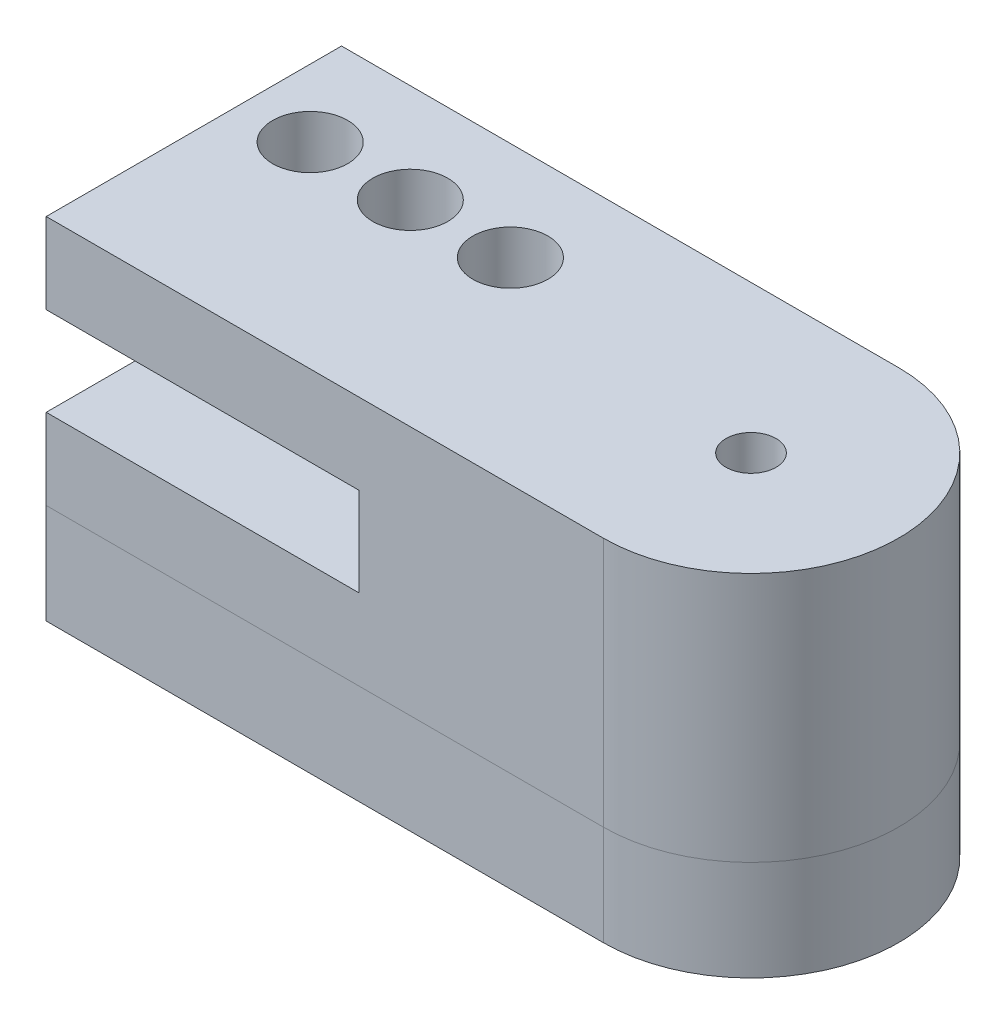
ISO-10303-21;
HEADER;
FILE_DESCRIPTION(('STEP AP214'),'2;1');
FILE_NAME('part.step','',(''),(''),'','','');
FILE_SCHEMA(('AUTOMOTIVE_DESIGN { 1 0 10303 214 1 1 1 1 }'));
ENDSEC;
DATA;
#1=APPLICATION_CONTEXT('core data for automotive mechanical design processes');
#2=APPLICATION_PROTOCOL_DEFINITION('international standard','automotive_design',2000,#1);
#3=PRODUCT_CONTEXT('',#1,'mechanical');
#4=PRODUCT('Part','Part','',(#3));
#5=PRODUCT_RELATED_PRODUCT_CATEGORY('part','',(#4));
#6=PRODUCT_DEFINITION_FORMATION('','',#4);
#7=PRODUCT_DEFINITION_CONTEXT('part definition',#1,'design');
#8=PRODUCT_DEFINITION('design','',#6,#7);
#9=PRODUCT_DEFINITION_SHAPE('','',#8);
#10=(LENGTH_UNIT() NAMED_UNIT(*) SI_UNIT(.MILLI.,.METRE.));
#11=(NAMED_UNIT(*) PLANE_ANGLE_UNIT() SI_UNIT($,.RADIAN.));
#12=(NAMED_UNIT(*) SI_UNIT($,.STERADIAN.) SOLID_ANGLE_UNIT());
#13=UNCERTAINTY_MEASURE_WITH_UNIT(LENGTH_MEASURE(1.E-05),#10,'distance_accuracy_value','');
#14=(GEOMETRIC_REPRESENTATION_CONTEXT(3) GLOBAL_UNCERTAINTY_ASSIGNED_CONTEXT((#13)) GLOBAL_UNIT_ASSIGNED_CONTEXT((#10,
#11,#12)) REPRESENTATION_CONTEXT('',''));
#15=CARTESIAN_POINT('',(0.,0.,0.));
#16=DIRECTION('',(0.,0.,1.));
#17=DIRECTION('',(1.,0.,0.));
#18=AXIS2_PLACEMENT_3D('',#15,#16,#17);
#19=CARTESIAN_POINT('',(19.8378099908885,10.,-13.8));
#20=DIRECTION('',(1.,0.,0.));
#21=DIRECTION('',(0.,0.,-1.));
#22=AXIS2_PLACEMENT_3D('',#19,#20,#21);
#23=PLANE('',#22);
#24=DIRECTION('',(0.,-1.,0.));
#25=VECTOR('',#24,1.);
#26=CARTESIAN_POINT('',(19.8378099908885,10.,-1.99947612195635));
#27=LINE('',#26,#25);
#28=CARTESIAN_POINT('',(19.8378099908885,3.225,-1.99947612195635));
#29=VERTEX_POINT('',#28);
#30=CARTESIAN_POINT('',(19.8378099908885,0.,-1.99973806097817));
#31=VERTEX_POINT('',#30);
#32=EDGE_CURVE('E273',#29,#31,#27,.T.);
#33=ORIENTED_EDGE('',*,*,#32,.F.);
#34=DIRECTION('',(0.,0.,-1.));
#35=VECTOR('',#34,1.);
#36=CARTESIAN_POINT('',(19.8378099908885,3.225,-13.8));
#37=LINE('',#36,#35);
#38=CARTESIAN_POINT('',(19.8378099908885,3.225,-13.8));
#39=VERTEX_POINT('',#38);
#40=EDGE_CURVE('E47',#29,#39,#37,.T.);
#41=ORIENTED_EDGE('',*,*,#40,.T.);
#42=DIRECTION('',(0.,-1.,0.));
#43=VECTOR('',#42,1.);
#44=CARTESIAN_POINT('',(19.8378099908885,10.,-13.8));
#45=LINE('',#44,#43);
#46=CARTESIAN_POINT('',(19.8378099908885,-4.,-13.8));
#47=VERTEX_POINT('',#46);
#48=EDGE_CURVE('E350',#39,#47,#45,.T.);
#49=ORIENTED_EDGE('',*,*,#48,.T.);
#50=DIRECTION('',(0.,0.,-1.));
#51=VECTOR('',#50,1.);
#52=CARTESIAN_POINT('',(19.8378099908885,-4.,-2.));
#53=LINE('',#52,#51);
#54=CARTESIAN_POINT('',(19.8378099908885,-4.,-2.));
#55=VERTEX_POINT('',#54);
#56=EDGE_CURVE('E206',#55,#47,#53,.T.);
#57=ORIENTED_EDGE('',*,*,#56,.F.);
#58=DIRECTION('',(0.,1.,0.));
#59=VECTOR('',#58,1.);
#60=CARTESIAN_POINT('',(19.8378099908885,-4.,-2.));
#61=LINE('',#60,#59);
#62=EDGE_CURVE('E345',#55,#31,#61,.T.);
#63=ORIENTED_EDGE('',*,*,#62,.T.);
#64=EDGE_LOOP('',(#33,#41,#49,#57,#63));
#65=FACE_BOUND('',#64,.T.);
#66=ADVANCED_FACE('F37',(#65),#23,.F.);
#67=CARTESIAN_POINT('',(19.8378099908885,10.,-1.99947612195635));
#68=DIRECTION('',(0.,0.,-1.));
#69=DIRECTION('',(-1.,0.,0.));
#70=AXIS2_PLACEMENT_3D('',#67,#68,#69);
#71=PLANE('',#70);
#72=DIRECTION('',(0.,1.,0.));
#73=VECTOR('',#72,1.);
#74=CARTESIAN_POINT('',(32.3378099908885,3.225,-1.99947612195635));
#75=LINE('',#74,#73);
#76=CARTESIAN_POINT('',(32.3378099908885,3.225,-1.99947612195635));
#77=VERTEX_POINT('',#76);
#78=CARTESIAN_POINT('',(32.3378099908885,6.775,-1.99947612195635));
#79=VERTEX_POINT('',#78);
#80=EDGE_CURVE('E146',#77,#79,#75,.T.);
#81=ORIENTED_EDGE('',*,*,#80,.F.);
#82=DIRECTION('',(1.,0.,0.));
#83=VECTOR('',#82,1.);
#84=CARTESIAN_POINT('',(19.8378099908885,3.225,-1.99947612195635));
#85=LINE('',#84,#83);
#86=EDGE_CURVE('E143',#29,#77,#85,.T.);
#87=ORIENTED_EDGE('',*,*,#86,.F.);
#88=ORIENTED_EDGE('',*,*,#32,.T.);
#89=CARTESIAN_POINT('',(19.8378099908885,0.,-1.99947612195635));
#90=DIRECTION('',(1.,0.,0.));
#91=VECTOR('',#90,1.);
#92=LINE('',#89,#91);
#93=CARTESIAN_POINT('',(42.1,0.,-1.99973806097817));
#94=VERTEX_POINT('',#93);
#95=EDGE_CURVE('E220',#31,#94,#92,.T.);
#96=ORIENTED_EDGE('',*,*,#95,.T.);
#97=DIRECTION('',(0.,-1.,0.));
#98=VECTOR('',#97,1.);
#99=CARTESIAN_POINT('',(42.1,10.,-1.99947612195635));
#100=LINE('',#99,#98);
#101=CARTESIAN_POINT('',(42.1,10.,-1.99947612195635));
#102=VERTEX_POINT('',#101);
#103=EDGE_CURVE('E269',#102,#94,#100,.T.);
#104=ORIENTED_EDGE('',*,*,#103,.F.);
#105=DIRECTION('',(1.,0.,0.));
#106=VECTOR('',#105,1.);
#107=CARTESIAN_POINT('',(19.8378099908885,10.,-1.99947612195635));
#108=LINE('',#107,#106);
#109=CARTESIAN_POINT('',(19.8378099908885,10.,-1.99947612195635));
#110=VERTEX_POINT('',#109);
#111=EDGE_CURVE('E366',#110,#102,#108,.T.);
#112=ORIENTED_EDGE('',*,*,#111,.F.);
#113=CARTESIAN_POINT('',(19.8378099908885,6.775,-1.99947612195635));
#114=VERTEX_POINT('',#113);
#115=EDGE_CURVE('E157',#110,#114,#27,.T.);
#116=ORIENTED_EDGE('',*,*,#115,.T.);
#117=DIRECTION('',(-1.,0.,0.));
#118=VECTOR('',#117,1.);
#119=CARTESIAN_POINT('',(19.8378099908885,6.775,-1.99947612195635));
#120=LINE('',#119,#118);
#121=EDGE_CURVE('E55',#79,#114,#120,.T.);
#122=ORIENTED_EDGE('',*,*,#121,.F.);
#123=EDGE_LOOP('',(#81,#87,#88,#96,#104,#112,#116,#122));
#124=FACE_BOUND('',#123,.T.);
#125=ADVANCED_FACE('F39',(#124),#71,.F.);
#126=CARTESIAN_POINT('',(42.1,10.,-7.89973806097817));
#127=DIRECTION('',(0.,-1.,0.));
#128=DIRECTION('',(0.,0.,-1.));
#129=AXIS2_PLACEMENT_3D('',#126,#127,#128);
#130=CYLINDRICAL_SURFACE('',#129,5.90026193902183);
#131=CARTESIAN_POINT('',(42.1,0.,-7.89973806097817));
#132=DIRECTION('',(0.,1.,0.));
#133=DIRECTION('',(0.,0.,1.));
#134=AXIS2_PLACEMENT_3D('',#131,#132,#133);
#135=CIRCLE('',#134,5.90026193902183);
#136=CARTESIAN_POINT('',(42.1,0.,-13.8));
#137=VERTEX_POINT('',#136);
#138=EDGE_CURVE('E369',#94,#137,#135,.T.);
#139=ORIENTED_EDGE('',*,*,#138,.T.);
#140=DIRECTION('',(0.,-1.,0.));
#141=VECTOR('',#140,1.);
#142=CARTESIAN_POINT('',(42.1,10.,-13.8));
#143=LINE('',#142,#141);
#144=CARTESIAN_POINT('',(42.1,10.,-13.8));
#145=VERTEX_POINT('',#144);
#146=EDGE_CURVE('E261',#145,#137,#143,.T.);
#147=ORIENTED_EDGE('',*,*,#146,.F.);
#148=CARTESIAN_POINT('',(42.1,10.,-7.89973806097817));
#149=DIRECTION('',(0.,1.,0.));
#150=DIRECTION('',(0.,0.,-1.));
#151=AXIS2_PLACEMENT_3D('',#148,#149,#150);
#152=CIRCLE('',#151,5.90026193902183);
#153=EDGE_CURVE('E364',#102,#145,#152,.T.);
#154=ORIENTED_EDGE('',*,*,#153,.F.);
#155=ORIENTED_EDGE('',*,*,#103,.T.);
#156=EDGE_LOOP('',(#139,#147,#154,#155));
#157=FACE_BOUND('',#156,.T.);
#158=ADVANCED_FACE('F249',(#157),#130,.T.);
#159=CARTESIAN_POINT('',(19.8378099908885,10.,-13.8));
#160=DIRECTION('',(0.,0.,1.));
#161=DIRECTION('',(1.,0.,0.));
#162=AXIS2_PLACEMENT_3D('',#159,#160,#161);
#163=PLANE('',#162);
#164=ORIENTED_EDGE('',*,*,#48,.F.);
#165=DIRECTION('',(1.,0.,0.));
#166=VECTOR('',#165,1.);
#167=CARTESIAN_POINT('',(19.8378099908885,3.225,-13.8));
#168=LINE('',#167,#166);
#169=CARTESIAN_POINT('',(32.3378099908885,3.225,-13.8));
#170=VERTEX_POINT('',#169);
#171=EDGE_CURVE('E164',#39,#170,#168,.T.);
#172=ORIENTED_EDGE('',*,*,#171,.T.);
#173=DIRECTION('',(0.,1.,0.));
#174=VECTOR('',#173,1.);
#175=CARTESIAN_POINT('',(32.3378099908885,10.,-13.8));
#176=LINE('',#175,#174);
#177=CARTESIAN_POINT('',(32.3378099908885,6.775,-13.8));
#178=VERTEX_POINT('',#177);
#179=EDGE_CURVE('E11',#170,#178,#176,.T.);
#180=ORIENTED_EDGE('',*,*,#179,.T.);
#181=DIRECTION('',(-1.,0.,0.));
#182=VECTOR('',#181,1.);
#183=CARTESIAN_POINT('',(19.8378099908885,6.775,-13.8));
#184=LINE('',#183,#182);
#185=CARTESIAN_POINT('',(19.8378099908885,6.775,-13.8));
#186=VERTEX_POINT('',#185);
#187=EDGE_CURVE('E140',#178,#186,#184,.T.);
#188=ORIENTED_EDGE('',*,*,#187,.T.);
#189=CARTESIAN_POINT('',(19.8378099908885,10.,-13.8));
#190=VERTEX_POINT('',#189);
#191=EDGE_CURVE('E270',#190,#186,#45,.T.);
#192=ORIENTED_EDGE('',*,*,#191,.F.);
#193=DIRECTION('',(-1.,0.,0.));
#194=VECTOR('',#193,1.);
#195=CARTESIAN_POINT('',(19.8378099908885,10.,-13.8));
#196=LINE('',#195,#194);
#197=EDGE_CURVE('E362',#145,#190,#196,.T.);
#198=ORIENTED_EDGE('',*,*,#197,.F.);
#199=ORIENTED_EDGE('',*,*,#146,.T.);
#200=DIRECTION('',(0.,1.,0.));
#201=VECTOR('',#200,1.);
#202=CARTESIAN_POINT('',(42.1,-4.,-13.8));
#203=LINE('',#202,#201);
#204=CARTESIAN_POINT('',(42.1,-4.,-13.8));
#205=VERTEX_POINT('',#204);
#206=EDGE_CURVE('E372',#205,#137,#203,.T.);
#207=ORIENTED_EDGE('',*,*,#206,.F.);
#208=DIRECTION('',(1.,0.,0.));
#209=VECTOR('',#208,1.);
#210=CARTESIAN_POINT('',(19.8378099908885,-4.,-13.8));
#211=LINE('',#210,#209);
#212=EDGE_CURVE('E209',#47,#205,#211,.T.);
#213=ORIENTED_EDGE('',*,*,#212,.F.);
#214=EDGE_LOOP('',(#164,#172,#180,#188,#192,#198,#199,#207,#213));
#215=FACE_BOUND('',#214,.T.);
#216=ADVANCED_FACE('F246',(#215),#163,.F.);
#217=ORIENTED_EDGE('',*,*,#191,.T.);
#218=DIRECTION('',(0.,0.,1.));
#219=VECTOR('',#218,1.);
#220=CARTESIAN_POINT('',(19.8378099908885,6.775,-13.8));
#221=LINE('',#220,#219);
#222=EDGE_CURVE('E277',#186,#114,#221,.T.);
#223=ORIENTED_EDGE('',*,*,#222,.T.);
#224=ORIENTED_EDGE('',*,*,#115,.F.);
#225=DIRECTION('',(0.,0.,1.));
#226=VECTOR('',#225,1.);
#227=CARTESIAN_POINT('',(19.8378099908885,10.,-13.8));
#228=LINE('',#227,#226);
#229=EDGE_CURVE('E276',#190,#110,#228,.T.);
#230=ORIENTED_EDGE('',*,*,#229,.F.);
#231=EDGE_LOOP('',(#217,#223,#224,#230));
#232=FACE_BOUND('',#231,.T.);
#233=ADVANCED_FACE('F242',(#232),#23,.F.);
#234=CARTESIAN_POINT('',(42.1,10.,-7.89973806097817));
#235=DIRECTION('',(0.,-1.,0.));
#236=DIRECTION('',(0.,0.,-1.));
#237=AXIS2_PLACEMENT_3D('',#234,#235,#236);
#238=PLANE('',#237);
#239=CARTESIAN_POINT('',(30.5349088704894,10.,-9.85));
#240=DIRECTION('',(0.,1.,0.));
#241=DIRECTION('',(0.,0.,1.));
#242=AXIS2_PLACEMENT_3D('',#239,#240,#241);
#243=CIRCLE('',#242,1.5);
#244=CARTESIAN_POINT('',(30.5349088704894,10.,-8.35));
#245=VERTEX_POINT('',#244);
#246=EDGE_CURVE('E296',#245,#245,#243,.T.);
#247=ORIENTED_EDGE('',*,*,#246,.F.);
#248=EDGE_LOOP('',(#247));
#249=FACE_BOUND('',#248,.T.);
#250=CARTESIAN_POINT('',(26.5349088704894,10.,-9.84999999999997));
#251=DIRECTION('',(0.,1.,0.));
#252=DIRECTION('',(0.,0.,1.));
#253=AXIS2_PLACEMENT_3D('',#250,#251,#252);
#254=CIRCLE('',#253,1.5);
#255=CARTESIAN_POINT('',(26.5349088704894,10.,-8.34999999999997));
#256=VERTEX_POINT('',#255);
#257=EDGE_CURVE('E452',#256,#256,#254,.T.);
#258=ORIENTED_EDGE('',*,*,#257,.F.);
#259=EDGE_LOOP('',(#258));
#260=FACE_BOUND('',#259,.T.);
#261=CARTESIAN_POINT('',(22.5349088704894,10.,-9.84999999999995));
#262=DIRECTION('',(0.,1.,0.));
#263=DIRECTION('',(0.,0.,1.));
#264=AXIS2_PLACEMENT_3D('',#261,#262,#263);
#265=CIRCLE('',#264,1.5);
#266=CARTESIAN_POINT('',(22.5349088704894,10.,-8.34999999999994));
#267=VERTEX_POINT('',#266);
#268=EDGE_CURVE('E448',#267,#267,#265,.T.);
#269=ORIENTED_EDGE('',*,*,#268,.F.);
#270=EDGE_LOOP('',(#269));
#271=FACE_BOUND('',#270,.T.);
#272=CARTESIAN_POINT('',(42.1,10.,-7.9));
#273=DIRECTION('',(0.,-1.,0.));
#274=DIRECTION('',(0.,0.,-1.));
#275=AXIS2_PLACEMENT_3D('',#272,#273,#274);
#276=CIRCLE('',#275,0.999999999999998);
#277=CARTESIAN_POINT('',(42.1,10.,-8.9));
#278=VERTEX_POINT('',#277);
#279=EDGE_CURVE('E170',#278,#278,#276,.T.);
#280=ORIENTED_EDGE('',*,*,#279,.T.);
#281=EDGE_LOOP('',(#280));
#282=FACE_BOUND('',#281,.T.);
#283=ORIENTED_EDGE('',*,*,#111,.T.);
#284=ORIENTED_EDGE('',*,*,#153,.T.);
#285=ORIENTED_EDGE('',*,*,#197,.T.);
#286=ORIENTED_EDGE('',*,*,#229,.T.);
#287=EDGE_LOOP('',(#283,#284,#285,#286));
#288=FACE_BOUND('',#287,.T.);
#289=ADVANCED_FACE('F237',(#249,#260,#271,#282,#288),#238,.F.);
#290=CARTESIAN_POINT('',(19.8378099908885,-4.,-2.));
#291=DIRECTION('',(0.,0.,-1.));
#292=DIRECTION('',(-1.,0.,0.));
#293=AXIS2_PLACEMENT_3D('',#290,#291,#292);
#294=PLANE('',#293);
#295=ORIENTED_EDGE('',*,*,#95,.F.);
#296=ORIENTED_EDGE('',*,*,#62,.F.);
#297=DIRECTION('',(-1.,0.,0.));
#298=VECTOR('',#297,1.);
#299=CARTESIAN_POINT('',(19.8378099908885,-4.,-2.));
#300=LINE('',#299,#298);
#301=CARTESIAN_POINT('',(42.1,-4.,-2.));
#302=VERTEX_POINT('',#301);
#303=EDGE_CURVE('E198',#302,#55,#300,.T.);
#304=ORIENTED_EDGE('',*,*,#303,.F.);
#305=DIRECTION('',(0.,1.,0.));
#306=VECTOR('',#305,1.);
#307=CARTESIAN_POINT('',(42.1,-4.,-2.));
#308=LINE('',#307,#306);
#309=EDGE_CURVE('E213',#302,#94,#308,.T.);
#310=ORIENTED_EDGE('',*,*,#309,.T.);
#311=EDGE_LOOP('',(#295,#296,#304,#310));
#312=FACE_BOUND('',#311,.T.);
#313=ADVANCED_FACE('F226',(#312),#294,.F.);
#314=CARTESIAN_POINT('',(42.1,-4.,-7.9));
#315=DIRECTION('',(0.,1.,0.));
#316=DIRECTION('',(0.,0.,1.));
#317=AXIS2_PLACEMENT_3D('',#314,#315,#316);
#318=CYLINDRICAL_SURFACE('',#317,5.9);
#319=ORIENTED_EDGE('',*,*,#138,.F.);
#320=ORIENTED_EDGE('',*,*,#309,.F.);
#321=CARTESIAN_POINT('',(42.1,-4.,-7.9));
#322=DIRECTION('',(0.,-1.,0.));
#323=DIRECTION('',(0.,0.,1.));
#324=AXIS2_PLACEMENT_3D('',#321,#322,#323);
#325=CIRCLE('',#324,5.9);
#326=EDGE_CURVE('E211',#205,#302,#325,.T.);
#327=ORIENTED_EDGE('',*,*,#326,.F.);
#328=ORIENTED_EDGE('',*,*,#206,.T.);
#329=EDGE_LOOP('',(#319,#320,#327,#328));
#330=FACE_BOUND('',#329,.T.);
#331=ADVANCED_FACE('F236',(#330),#318,.T.);
#332=CARTESIAN_POINT('',(42.1,-4.,-7.9));
#333=DIRECTION('',(0.,1.,0.));
#334=DIRECTION('',(0.,0.,1.));
#335=AXIS2_PLACEMENT_3D('',#332,#333,#334);
#336=PLANE('',#335);
#337=CARTESIAN_POINT('',(30.5349088704894,-4.,-9.85));
#338=DIRECTION('',(0.,1.,0.));
#339=DIRECTION('',(0.,0.,1.));
#340=AXIS2_PLACEMENT_3D('',#337,#338,#339);
#341=CIRCLE('',#340,1.5);
#342=CARTESIAN_POINT('',(30.5349088704894,-4.,-8.35));
#343=VERTEX_POINT('',#342);
#344=EDGE_CURVE('E152',#343,#343,#341,.T.);
#345=ORIENTED_EDGE('',*,*,#344,.T.);
#346=EDGE_LOOP('',(#345));
#347=FACE_BOUND('',#346,.T.);
#348=CARTESIAN_POINT('',(26.5349088704894,-4.,-9.84999999999997));
#349=DIRECTION('',(0.,1.,0.));
#350=DIRECTION('',(0.,0.,1.));
#351=AXIS2_PLACEMENT_3D('',#348,#349,#350);
#352=CIRCLE('',#351,1.5);
#353=CARTESIAN_POINT('',(26.5349088704894,-4.,-8.34999999999997));
#354=VERTEX_POINT('',#353);
#355=EDGE_CURVE('E304',#354,#354,#352,.T.);
#356=ORIENTED_EDGE('',*,*,#355,.T.);
#357=EDGE_LOOP('',(#356));
#358=FACE_BOUND('',#357,.T.);
#359=CARTESIAN_POINT('',(22.5349088704894,-4.,-9.84999999999995));
#360=DIRECTION('',(0.,1.,0.));
#361=DIRECTION('',(0.,0.,1.));
#362=AXIS2_PLACEMENT_3D('',#359,#360,#361);
#363=CIRCLE('',#362,1.5);
#364=CARTESIAN_POINT('',(22.5349088704894,-4.,-8.34999999999994));
#365=VERTEX_POINT('',#364);
#366=EDGE_CURVE('E300',#365,#365,#363,.T.);
#367=ORIENTED_EDGE('',*,*,#366,.T.);
#368=EDGE_LOOP('',(#367));
#369=FACE_BOUND('',#368,.T.);
#370=DIRECTION('',(0.953716950748227,0.,-0.300705799504274));
#371=VECTOR('',#370,1.);
#372=CARTESIAN_POINT('',(27.8927615653599,-4.,-6.71951343534622));
#373=LINE('',#372,#371);
#374=CARTESIAN_POINT('',(27.8927615653599,-4.,-6.71951343534622));
#375=VERTEX_POINT('',#374);
#376=CARTESIAN_POINT('',(39.2610676182788,-4.,-10.3039265654372));
#377=VERTEX_POINT('',#376);
#378=EDGE_CURVE('E188',#375,#377,#373,.T.);
#379=ORIENTED_EDGE('',*,*,#378,.F.);
#380=CARTESIAN_POINT('',(28.3363501992225,-4.,-4.76932648945926));
#381=DIRECTION('',(0.,-1.,0.));
#382=DIRECTION('',(0.,0.,-1.));
#383=AXIS2_PLACEMENT_3D('',#380,#381,#382);
#384=CIRCLE('',#383,2.);
#385=CARTESIAN_POINT('',(28.7799388330851,-4.,-2.81913954357231));
#386=VERTEX_POINT('',#385);
#387=EDGE_CURVE('E63',#386,#375,#384,.T.);
#388=ORIENTED_EDGE('',*,*,#387,.F.);
#389=DIRECTION('',(-0.989952492029198,0.,0.141400366071594));
#390=VECTOR('',#389,1.);
#391=CARTESIAN_POINT('',(28.7799388330851,-4.,-2.81913954357231));
#392=LINE('',#391,#390);
#393=CARTESIAN_POINT('',(40.5801725380732,-4.,-4.50463190714571));
#394=VERTEX_POINT('',#393);
#395=EDGE_CURVE('E177',#394,#386,#392,.T.);
#396=ORIENTED_EDGE('',*,*,#395,.F.);
#397=CARTESIAN_POINT('',(42.1,-4.,-7.9));
#398=DIRECTION('',(0.,-1.,0.));
#399=DIRECTION('',(0.,0.,-1.));
#400=AXIS2_PLACEMENT_3D('',#397,#398,#399);
#401=CIRCLE('',#400,3.72);
#402=EDGE_CURVE('E191',#377,#394,#401,.T.);
#403=ORIENTED_EDGE('',*,*,#402,.F.);
#404=EDGE_LOOP('',(#379,#388,#396,#403));
#405=FACE_BOUND('',#404,.T.);
#406=ORIENTED_EDGE('',*,*,#303,.T.);
#407=ORIENTED_EDGE('',*,*,#56,.T.);
#408=ORIENTED_EDGE('',*,*,#212,.T.);
#409=ORIENTED_EDGE('',*,*,#326,.T.);
#410=EDGE_LOOP('',(#406,#407,#408,#409));
#411=FACE_BOUND('',#410,.T.);
#412=ADVANCED_FACE('F321',(#347,#358,#369,#405,#411),#336,.F.);
#413=CARTESIAN_POINT('',(28.3363501992225,0.,-4.76932648945926));
#414=DIRECTION('',(0.,-1.,0.));
#415=DIRECTION('',(0.,0.,-1.));
#416=AXIS2_PLACEMENT_3D('',#413,#414,#415);
#417=CYLINDRICAL_SURFACE('',#416,2.);
#418=ORIENTED_EDGE('',*,*,#387,.T.);
#419=DIRECTION('',(0.,-1.,0.));
#420=VECTOR('',#419,1.);
#421=CARTESIAN_POINT('',(27.8927615653599,0.,-6.71951343534622));
#422=LINE('',#421,#420);
#423=CARTESIAN_POINT('',(27.8927615653599,0.,-6.71951343534622));
#424=VERTEX_POINT('',#423);
#425=EDGE_CURVE('E186',#424,#375,#422,.T.);
#426=ORIENTED_EDGE('',*,*,#425,.F.);
#427=CARTESIAN_POINT('',(28.3363501992225,0.,-4.76932648945926));
#428=DIRECTION('',(0.,-1.,0.));
#429=DIRECTION('',(0.,0.,-1.));
#430=AXIS2_PLACEMENT_3D('',#427,#428,#429);
#431=CIRCLE('',#430,2.);
#432=CARTESIAN_POINT('',(28.7799388330851,0.,-2.81913954357231));
#433=VERTEX_POINT('',#432);
#434=EDGE_CURVE('E173',#433,#424,#431,.T.);
#435=ORIENTED_EDGE('',*,*,#434,.F.);
#436=DIRECTION('',(0.,-1.,0.));
#437=VECTOR('',#436,1.);
#438=CARTESIAN_POINT('',(28.7799388330851,0.,-2.81913954357231));
#439=LINE('',#438,#437);
#440=EDGE_CURVE('E196',#433,#386,#439,.T.);
#441=ORIENTED_EDGE('',*,*,#440,.T.);
#442=EDGE_LOOP('',(#418,#426,#435,#441));
#443=FACE_BOUND('',#442,.T.);
#444=ADVANCED_FACE('F397',(#443),#417,.F.);
#445=CARTESIAN_POINT('',(28.7799388330851,0.,-2.81913954357231));
#446=DIRECTION('',(0.141400366071594,0.,0.989952492029198));
#447=DIRECTION('',(0.989952492029198,0.,-0.141400366071594));
#448=AXIS2_PLACEMENT_3D('',#445,#446,#447);
#449=PLANE('',#448);
#450=ORIENTED_EDGE('',*,*,#395,.T.);
#451=ORIENTED_EDGE('',*,*,#440,.F.);
#452=DIRECTION('',(-0.989952492029198,0.,0.141400366071594));
#453=VECTOR('',#452,1.);
#454=CARTESIAN_POINT('',(28.7799388330851,0.,-2.81913954357231));
#455=LINE('',#454,#453);
#456=CARTESIAN_POINT('',(40.5801725380732,0.,-4.50463190714571));
#457=VERTEX_POINT('',#456);
#458=EDGE_CURVE('E183',#457,#433,#455,.T.);
#459=ORIENTED_EDGE('',*,*,#458,.F.);
#460=DIRECTION('',(0.,-1.,0.));
#461=VECTOR('',#460,1.);
#462=CARTESIAN_POINT('',(40.5801725380732,0.,-4.50463190714571));
#463=LINE('',#462,#461);
#464=EDGE_CURVE('E199',#457,#394,#463,.T.);
#465=ORIENTED_EDGE('',*,*,#464,.T.);
#466=EDGE_LOOP('',(#450,#451,#459,#465));
#467=FACE_BOUND('',#466,.T.);
#468=ADVANCED_FACE('F402',(#467),#449,.F.);
#469=CARTESIAN_POINT('',(42.1,0.,-7.9));
#470=DIRECTION('',(0.,-1.,0.));
#471=DIRECTION('',(0.,0.,-1.));
#472=AXIS2_PLACEMENT_3D('',#469,#470,#471);
#473=CYLINDRICAL_SURFACE('',#472,3.72);
#474=ORIENTED_EDGE('',*,*,#402,.T.);
#475=ORIENTED_EDGE('',*,*,#464,.F.);
#476=CARTESIAN_POINT('',(42.1,0.,-7.9));
#477=DIRECTION('',(0.,-1.,0.));
#478=DIRECTION('',(0.,0.,-1.));
#479=AXIS2_PLACEMENT_3D('',#476,#477,#478);
#480=CIRCLE('',#479,3.72);
#481=CARTESIAN_POINT('',(39.2610676182788,0.,-10.3039265654372));
#482=VERTEX_POINT('',#481);
#483=EDGE_CURVE('E180',#482,#457,#480,.T.);
#484=ORIENTED_EDGE('',*,*,#483,.F.);
#485=DIRECTION('',(0.,-1.,0.));
#486=VECTOR('',#485,1.);
#487=CARTESIAN_POINT('',(39.2610676182788,0.,-10.3039265654372));
#488=LINE('',#487,#486);
#489=EDGE_CURVE('E201',#482,#377,#488,.T.);
#490=ORIENTED_EDGE('',*,*,#489,.T.);
#491=EDGE_LOOP('',(#474,#475,#484,#490));
#492=FACE_BOUND('',#491,.T.);
#493=ADVANCED_FACE('F409',(#492),#473,.F.);
#494=CARTESIAN_POINT('',(27.8927615653599,0.,-6.71951343534622));
#495=DIRECTION('',(-0.300705799504274,0.,-0.953716950748227));
#496=DIRECTION('',(-0.953716950748227,0.,0.300705799504274));
#497=AXIS2_PLACEMENT_3D('',#494,#495,#496);
#498=PLANE('',#497);
#499=ORIENTED_EDGE('',*,*,#378,.T.);
#500=ORIENTED_EDGE('',*,*,#489,.F.);
#501=DIRECTION('',(0.953716950748227,0.,-0.300705799504274));
#502=VECTOR('',#501,1.);
#503=CARTESIAN_POINT('',(27.8927615653599,0.,-6.71951343534622));
#504=LINE('',#503,#502);
#505=EDGE_CURVE('E176',#424,#482,#504,.T.);
#506=ORIENTED_EDGE('',*,*,#505,.F.);
#507=ORIENTED_EDGE('',*,*,#425,.T.);
#508=EDGE_LOOP('',(#499,#500,#506,#507));
#509=FACE_BOUND('',#508,.T.);
#510=ADVANCED_FACE('F405',(#509),#498,.F.);
#511=CARTESIAN_POINT('',(28.3363501992225,0.,-4.76932648945926));
#512=DIRECTION('',(0.,-1.,0.));
#513=DIRECTION('',(0.,0.,-1.));
#514=AXIS2_PLACEMENT_3D('',#511,#512,#513);
#515=PLANE('',#514);
#516=CARTESIAN_POINT('',(42.1,0.,-7.9));
#517=DIRECTION('',(0.,-1.,0.));
#518=DIRECTION('',(0.,0.,-1.));
#519=AXIS2_PLACEMENT_3D('',#516,#517,#518);
#520=CIRCLE('',#519,0.999999999999998);
#521=CARTESIAN_POINT('',(42.1,0.,-8.9));
#522=VERTEX_POINT('',#521);
#523=EDGE_CURVE('E167',#522,#522,#520,.T.);
#524=ORIENTED_EDGE('',*,*,#523,.F.);
#525=EDGE_LOOP('',(#524));
#526=FACE_BOUND('',#525,.T.);
#527=ORIENTED_EDGE('',*,*,#434,.T.);
#528=ORIENTED_EDGE('',*,*,#505,.T.);
#529=ORIENTED_EDGE('',*,*,#483,.T.);
#530=ORIENTED_EDGE('',*,*,#458,.T.);
#531=EDGE_LOOP('',(#527,#528,#529,#530));
#532=FACE_BOUND('',#531,.T.);
#533=ADVANCED_FACE('F408',(#526,#532),#515,.T.);
#534=CARTESIAN_POINT('',(42.1,10.000025,-7.9));
#535=DIRECTION('',(0.,-1.,0.));
#536=DIRECTION('',(0.,0.,-1.));
#537=AXIS2_PLACEMENT_3D('',#534,#535,#536);
#538=CYLINDRICAL_SURFACE('',#537,0.999999999999998);
#539=ORIENTED_EDGE('',*,*,#523,.T.);
#540=EDGE_LOOP('',(#539));
#541=FACE_BOUND('',#540,.T.);
#542=ORIENTED_EDGE('',*,*,#279,.F.);
#543=EDGE_LOOP('',(#542));
#544=FACE_BOUND('',#543,.T.);
#545=ADVANCED_FACE('F419',(#541,#544),#538,.F.);
#546=CARTESIAN_POINT('',(32.3378099908885,3.225,-13.85));
#547=DIRECTION('',(1.,0.,0.));
#548=DIRECTION('',(0.,0.,-1.));
#549=AXIS2_PLACEMENT_3D('',#546,#547,#548);
#550=PLANE('',#549);
#551=DIRECTION('',(0.,0.,1.));
#552=VECTOR('',#551,1.);
#553=CARTESIAN_POINT('',(32.3378099908885,3.225,-13.85));
#554=LINE('',#553,#552);
#555=EDGE_CURVE('E142',#170,#77,#554,.T.);
#556=ORIENTED_EDGE('',*,*,#555,.T.);
#557=ORIENTED_EDGE('',*,*,#80,.T.);
#558=DIRECTION('',(0.,0.,1.));
#559=VECTOR('',#558,1.);
#560=CARTESIAN_POINT('',(32.3378099908885,6.775,-13.85));
#561=LINE('',#560,#559);
#562=EDGE_CURVE('E136',#178,#79,#561,.T.);
#563=ORIENTED_EDGE('',*,*,#562,.F.);
#564=ORIENTED_EDGE('',*,*,#179,.F.);
#565=EDGE_LOOP('',(#556,#557,#563,#564));
#566=FACE_BOUND('',#565,.T.);
#567=ADVANCED_FACE('F147',(#566),#550,.F.);
#568=CARTESIAN_POINT('',(19.8378099908885,3.225,-13.85));
#569=DIRECTION('',(0.,-1.,0.));
#570=DIRECTION('',(0.,0.,-1.));
#571=AXIS2_PLACEMENT_3D('',#568,#569,#570);
#572=PLANE('',#571);
#573=CARTESIAN_POINT('',(30.5349088704894,3.225,-9.85));
#574=DIRECTION('',(0.,-1.,0.));
#575=DIRECTION('',(0.,0.,-1.));
#576=AXIS2_PLACEMENT_3D('',#573,#574,#575);
#577=CIRCLE('',#576,1.5);
#578=CARTESIAN_POINT('',(30.5349088704894,3.225,-11.35));
#579=VERTEX_POINT('',#578);
#580=EDGE_CURVE('E316',#579,#579,#577,.T.);
#581=ORIENTED_EDGE('',*,*,#580,.T.);
#582=EDGE_LOOP('',(#581));
#583=FACE_BOUND('',#582,.T.);
#584=CARTESIAN_POINT('',(26.5349088704894,3.225,-9.84999999999997));
#585=DIRECTION('',(0.,-1.,0.));
#586=DIRECTION('',(0.,0.,-1.));
#587=AXIS2_PLACEMENT_3D('',#584,#585,#586);
#588=CIRCLE('',#587,1.5);
#589=CARTESIAN_POINT('',(26.5349088704894,3.225,-11.35));
#590=VERTEX_POINT('',#589);
#591=EDGE_CURVE('E299',#590,#590,#588,.T.);
#592=ORIENTED_EDGE('',*,*,#591,.T.);
#593=EDGE_LOOP('',(#592));
#594=FACE_BOUND('',#593,.T.);
#595=CARTESIAN_POINT('',(22.5349088704894,3.225,-9.84999999999995));
#596=DIRECTION('',(0.,-1.,0.));
#597=DIRECTION('',(0.,0.,-1.));
#598=AXIS2_PLACEMENT_3D('',#595,#596,#597);
#599=CIRCLE('',#598,1.5);
#600=CARTESIAN_POINT('',(22.5349088704894,3.225,-11.3499999999999));
#601=VERTEX_POINT('',#600);
#602=EDGE_CURVE('E295',#601,#601,#599,.T.);
#603=ORIENTED_EDGE('',*,*,#602,.T.);
#604=EDGE_LOOP('',(#603));
#605=FACE_BOUND('',#604,.T.);
#606=ORIENTED_EDGE('',*,*,#40,.F.);
#607=ORIENTED_EDGE('',*,*,#86,.T.);
#608=ORIENTED_EDGE('',*,*,#555,.F.);
#609=ORIENTED_EDGE('',*,*,#171,.F.);
#610=EDGE_LOOP('',(#606,#607,#608,#609));
#611=FACE_BOUND('',#610,.T.);
#612=ADVANCED_FACE('F348',(#583,#594,#605,#611),#572,.F.);
#613=CARTESIAN_POINT('',(19.8378099908885,6.775,-13.85));
#614=DIRECTION('',(0.,1.,0.));
#615=DIRECTION('',(0.,0.,1.));
#616=AXIS2_PLACEMENT_3D('',#613,#614,#615);
#617=PLANE('',#616);
#618=CARTESIAN_POINT('',(30.5349088704894,6.775,-9.85));
#619=DIRECTION('',(0.,1.,0.));
#620=DIRECTION('',(0.,0.,1.));
#621=AXIS2_PLACEMENT_3D('',#618,#619,#620);
#622=CIRCLE('',#621,1.5);
#623=CARTESIAN_POINT('',(30.5349088704894,6.775,-8.35));
#624=VERTEX_POINT('',#623);
#625=EDGE_CURVE('E42',#624,#624,#622,.T.);
#626=ORIENTED_EDGE('',*,*,#625,.T.);
#627=EDGE_LOOP('',(#626));
#628=FACE_BOUND('',#627,.T.);
#629=CARTESIAN_POINT('',(26.5349088704894,6.775,-9.84999999999997));
#630=DIRECTION('',(0.,1.,0.));
#631=DIRECTION('',(0.,0.,1.));
#632=AXIS2_PLACEMENT_3D('',#629,#630,#631);
#633=CIRCLE('',#632,1.5);
#634=CARTESIAN_POINT('',(26.5349088704894,6.775,-8.34999999999997));
#635=VERTEX_POINT('',#634);
#636=EDGE_CURVE('E297',#635,#635,#633,.T.);
#637=ORIENTED_EDGE('',*,*,#636,.T.);
#638=EDGE_LOOP('',(#637));
#639=FACE_BOUND('',#638,.T.);
#640=CARTESIAN_POINT('',(22.5349088704894,6.775,-9.84999999999995));
#641=DIRECTION('',(0.,1.,0.));
#642=DIRECTION('',(0.,0.,1.));
#643=AXIS2_PLACEMENT_3D('',#640,#641,#642);
#644=CIRCLE('',#643,1.5);
#645=CARTESIAN_POINT('',(22.5349088704894,6.775,-8.34999999999994));
#646=VERTEX_POINT('',#645);
#647=EDGE_CURVE('E293',#646,#646,#644,.T.);
#648=ORIENTED_EDGE('',*,*,#647,.T.);
#649=EDGE_LOOP('',(#648));
#650=FACE_BOUND('',#649,.T.);
#651=ORIENTED_EDGE('',*,*,#562,.T.);
#652=ORIENTED_EDGE('',*,*,#121,.T.);
#653=ORIENTED_EDGE('',*,*,#222,.F.);
#654=ORIENTED_EDGE('',*,*,#187,.F.);
#655=EDGE_LOOP('',(#651,#652,#653,#654));
#656=FACE_BOUND('',#655,.T.);
#657=ADVANCED_FACE('F138',(#628,#639,#650,#656),#617,.F.);
#658=CARTESIAN_POINT('',(22.5349088704894,-4.000025,-9.84999999999995));
#659=DIRECTION('',(0.,1.,0.));
#660=DIRECTION('',(0.,0.,1.));
#661=AXIS2_PLACEMENT_3D('',#658,#659,#660);
#662=CYLINDRICAL_SURFACE('',#661,1.5);
#663=ORIENTED_EDGE('',*,*,#268,.T.);
#664=EDGE_LOOP('',(#663));
#665=FACE_BOUND('',#664,.T.);
#666=ORIENTED_EDGE('',*,*,#647,.F.);
#667=EDGE_LOOP('',(#666));
#668=FACE_BOUND('',#667,.T.);
#669=ADVANCED_FACE('F428',(#665,#668),#662,.F.);
#670=CARTESIAN_POINT('',(26.5349088704894,-4.000025,-9.84999999999997));
#671=DIRECTION('',(0.,1.,0.));
#672=DIRECTION('',(0.,0.,1.));
#673=AXIS2_PLACEMENT_3D('',#670,#671,#672);
#674=CYLINDRICAL_SURFACE('',#673,1.5);
#675=ORIENTED_EDGE('',*,*,#257,.T.);
#676=EDGE_LOOP('',(#675));
#677=FACE_BOUND('',#676,.T.);
#678=ORIENTED_EDGE('',*,*,#636,.F.);
#679=EDGE_LOOP('',(#678));
#680=FACE_BOUND('',#679,.T.);
#681=ADVANCED_FACE('F336',(#677,#680),#674,.F.);
#682=CARTESIAN_POINT('',(30.5349088704894,-4.000025,-9.85));
#683=DIRECTION('',(0.,1.,0.));
#684=DIRECTION('',(0.,0.,1.));
#685=AXIS2_PLACEMENT_3D('',#682,#683,#684);
#686=CYLINDRICAL_SURFACE('',#685,1.5);
#687=ORIENTED_EDGE('',*,*,#246,.T.);
#688=EDGE_LOOP('',(#687));
#689=FACE_BOUND('',#688,.T.);
#690=ORIENTED_EDGE('',*,*,#625,.F.);
#691=EDGE_LOOP('',(#690));
#692=FACE_BOUND('',#691,.T.);
#693=ADVANCED_FACE('F329',(#689,#692),#686,.F.);
#694=ORIENTED_EDGE('',*,*,#602,.F.);
#695=EDGE_LOOP('',(#694));
#696=FACE_BOUND('',#695,.T.);
#697=ORIENTED_EDGE('',*,*,#366,.F.);
#698=EDGE_LOOP('',(#697));
#699=FACE_BOUND('',#698,.T.);
#700=ADVANCED_FACE('F333',(#696,#699),#662,.F.);
#701=ORIENTED_EDGE('',*,*,#591,.F.);
#702=EDGE_LOOP('',(#701));
#703=FACE_BOUND('',#702,.T.);
#704=ORIENTED_EDGE('',*,*,#355,.F.);
#705=EDGE_LOOP('',(#704));
#706=FACE_BOUND('',#705,.T.);
#707=ADVANCED_FACE('F326',(#703,#706),#674,.F.);
#708=ORIENTED_EDGE('',*,*,#580,.F.);
#709=EDGE_LOOP('',(#708));
#710=FACE_BOUND('',#709,.T.);
#711=ORIENTED_EDGE('',*,*,#344,.F.);
#712=EDGE_LOOP('',(#711));
#713=FACE_BOUND('',#712,.T.);
#714=ADVANCED_FACE('F324',(#710,#713),#686,.F.);
#715=CLOSED_SHELL('',(#66,#125,#158,#216,#233,#289,#313,#331,#412,#444,#468,#493,#510,#533,#545,
#567,#612,#657,#669,#681,#693,#700,#707,#714));
#716=MANIFOLD_SOLID_BREP('B2',#715);
#717=ADVANCED_BREP_SHAPE_REPRESENTATION('',(#18,#716),#14);
#718=SHAPE_DEFINITION_REPRESENTATION(#9,#717);
ENDSEC;
END-ISO-10303-21;
